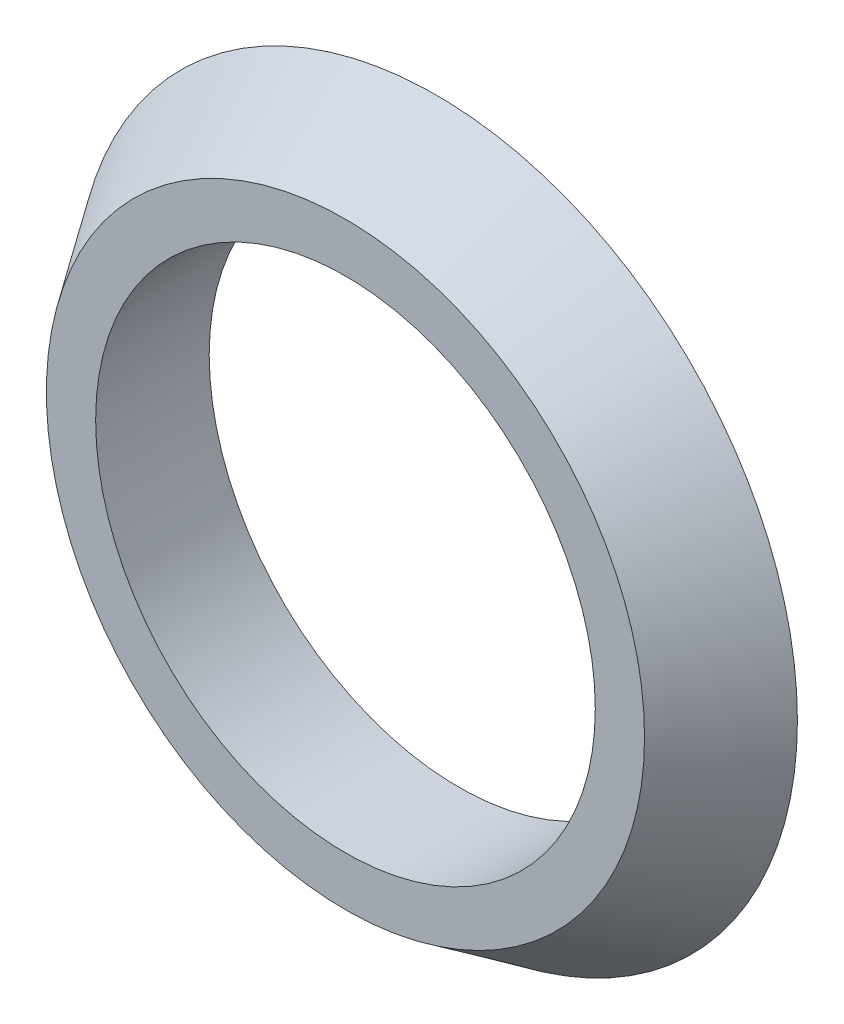
ISO-10303-21;
HEADER;
FILE_DESCRIPTION(('STEP AP214'),'2;1');
FILE_NAME('part.step','',(''),(''),'','','');
FILE_SCHEMA(('AUTOMOTIVE_DESIGN { 1 0 10303 214 1 1 1 1 }'));
ENDSEC;
DATA;
#1=APPLICATION_CONTEXT('core data for automotive mechanical design processes');
#2=APPLICATION_PROTOCOL_DEFINITION('international standard','automotive_design',2000,#1);
#3=PRODUCT_CONTEXT('',#1,'mechanical');
#4=PRODUCT('Part','Part','',(#3));
#5=PRODUCT_RELATED_PRODUCT_CATEGORY('part','',(#4));
#6=PRODUCT_DEFINITION_FORMATION('','',#4);
#7=PRODUCT_DEFINITION_CONTEXT('part definition',#1,'design');
#8=PRODUCT_DEFINITION('design','',#6,#7);
#9=PRODUCT_DEFINITION_SHAPE('','',#8);
#10=(LENGTH_UNIT() NAMED_UNIT(*) SI_UNIT(.MILLI.,.METRE.));
#11=(NAMED_UNIT(*) PLANE_ANGLE_UNIT() SI_UNIT($,.RADIAN.));
#12=(NAMED_UNIT(*) SI_UNIT($,.STERADIAN.) SOLID_ANGLE_UNIT());
#13=UNCERTAINTY_MEASURE_WITH_UNIT(LENGTH_MEASURE(1.E-05),#10,'distance_accuracy_value','');
#14=(GEOMETRIC_REPRESENTATION_CONTEXT(3) GLOBAL_UNCERTAINTY_ASSIGNED_CONTEXT((#13)) GLOBAL_UNIT_ASSIGNED_CONTEXT((#10,
#11,#12)) REPRESENTATION_CONTEXT('',''));
#15=CARTESIAN_POINT('',(0.,0.,0.));
#16=DIRECTION('',(0.,0.,1.));
#17=DIRECTION('',(1.,0.,0.));
#18=AXIS2_PLACEMENT_3D('',#15,#16,#17);
#19=CARTESIAN_POINT('',(0.,0.,2.));
#20=DIRECTION('',(0.,0.,-1.));
#21=DIRECTION('',(1.,0.,0.));
#22=AXIS2_PLACEMENT_3D('',#19,#20,#21);
#23=CYLINDRICAL_SURFACE('',#22,5.5);
#24=CARTESIAN_POINT('',(0.,0.,-0.5));
#25=DIRECTION('',(0.,0.,1.));
#26=DIRECTION('',(-1.,0.,0.));
#27=AXIS2_PLACEMENT_3D('',#24,#25,#26);
#28=CIRCLE('',#27,5.500000003344);
#29=CARTESIAN_POINT('',(-5.500000003344,0.,-0.5));
#30=VERTEX_POINT('',#29);
#31=EDGE_CURVE('E10',#30,#30,#28,.T.);
#32=ORIENTED_EDGE('',*,*,#31,.F.);
#33=EDGE_LOOP('',(#32));
#34=FACE_BOUND('',#33,.T.);
#35=CARTESIAN_POINT('',(0.,0.,2.));
#36=DIRECTION('',(0.,0.,-1.));
#37=DIRECTION('',(1.,0.,0.));
#38=AXIS2_PLACEMENT_3D('',#35,#36,#37);
#39=CIRCLE('',#38,5.499999997123);
#40=CARTESIAN_POINT('',(5.499999997123,0.,2.));
#41=VERTEX_POINT('',#40);
#42=EDGE_CURVE('E19',#41,#41,#39,.T.);
#43=ORIENTED_EDGE('',*,*,#42,.F.);
#44=EDGE_LOOP('',(#43));
#45=FACE_BOUND('',#44,.T.);
#46=ADVANCED_FACE('F15',(#34,#45),#23,.F.);
#47=CARTESIAN_POINT('',(6.072,-6.072,-0.5));
#48=DIRECTION('',(0.,0.,-1.));
#49=DIRECTION('',(0.,-1.,0.));
#50=AXIS2_PLACEMENT_3D('',#47,#48,#49);
#51=PLANE('',#50);
#52=ORIENTED_EDGE('',*,*,#31,.T.);
#53=EDGE_LOOP('',(#52));
#54=FACE_BOUND('',#53,.T.);
#55=CARTESIAN_POINT('',(0.,0.,-0.5));
#56=DIRECTION('',(0.,0.,-1.));
#57=DIRECTION('',(-1.,0.,0.));
#58=AXIS2_PLACEMENT_3D('',#55,#56,#57);
#59=CIRCLE('',#58,5.999999997024);
#60=CARTESIAN_POINT('',(-5.999999997024,0.,-0.5));
#61=VERTEX_POINT('',#60);
#62=EDGE_CURVE('E24',#61,#61,#59,.T.);
#63=ORIENTED_EDGE('',*,*,#62,.T.);
#64=EDGE_LOOP('',(#63));
#65=FACE_BOUND('',#64,.T.);
#66=ADVANCED_FACE('F17',(#54,#65),#51,.T.);
#67=CARTESIAN_POINT('',(0.,0.,-0.5));
#68=DIRECTION('',(0.,0.,1.));
#69=DIRECTION('',(1.,0.,0.));
#70=AXIS2_PLACEMENT_3D('',#67,#68,#69);
#71=CYLINDRICAL_SURFACE('',#70,6.);
#72=CARTESIAN_POINT('',(0.,0.,0.));
#73=DIRECTION('',(0.,0.,-1.));
#74=DIRECTION('',(1.,0.,0.));
#75=AXIS2_PLACEMENT_3D('',#72,#73,#74);
#76=CIRCLE('',#75,6.000000000667);
#77=CARTESIAN_POINT('',(6.000000000667,0.,0.));
#78=VERTEX_POINT('',#77);
#79=EDGE_CURVE('E36',#78,#78,#76,.T.);
#80=ORIENTED_EDGE('',*,*,#79,.T.);
#81=EDGE_LOOP('',(#80));
#82=FACE_BOUND('',#81,.T.);
#83=ORIENTED_EDGE('',*,*,#62,.F.);
#84=EDGE_LOOP('',(#83));
#85=FACE_BOUND('',#84,.T.);
#86=ADVANCED_FACE('F74',(#82,#85),#71,.T.);
#87=CARTESIAN_POINT('',(-6.663613888,-6.663613888,2.));
#88=DIRECTION('',(0.,0.,1.));
#89=DIRECTION('',(1.,0.,0.));
#90=AXIS2_PLACEMENT_3D('',#87,#88,#89);
#91=PLANE('',#90);
#92=ORIENTED_EDGE('',*,*,#42,.T.);
#93=EDGE_LOOP('',(#92));
#94=FACE_BOUND('',#93,.T.);
#95=CARTESIAN_POINT('',(0.,0.,2.));
#96=DIRECTION('',(0.,0.,1.));
#97=DIRECTION('',(1.,0.,0.));
#98=AXIS2_PLACEMENT_3D('',#95,#96,#97);
#99=CIRCLE('',#98,6.584598700291);
#100=CARTESIAN_POINT('',(6.584598700291,0.,2.));
#101=VERTEX_POINT('',#100);
#102=EDGE_CURVE('E38',#101,#101,#99,.T.);
#103=ORIENTED_EDGE('',*,*,#102,.T.);
#104=EDGE_LOOP('',(#103));
#105=FACE_BOUND('',#104,.T.);
#106=ADVANCED_FACE('F65',(#94,#105),#91,.T.);
#107=CARTESIAN_POINT('',(0.,0.,1.));
#108=DIRECTION('',(0.,0.,-1.));
#109=DIRECTION('',(-1.,0.,0.));
#110=AXIS2_PLACEMENT_3D('',#107,#108,#109);
#111=CONICAL_SURFACE('',#110,7.267299352,0.599021063042);
#112=CARTESIAN_POINT('',(0.,0.,0.));
#113=DIRECTION('',(0.,0.,-1.));
#114=DIRECTION('',(1.,0.,0.));
#115=AXIS2_PLACEMENT_3D('',#112,#113,#114);
#116=CIRCLE('',#115,7.949999996057);
#117=CARTESIAN_POINT('',(7.949999996057,0.,0.));
#118=VERTEX_POINT('',#117);
#119=EDGE_CURVE('E49',#118,#118,#116,.T.);
#120=ORIENTED_EDGE('',*,*,#119,.F.);
#121=EDGE_LOOP('',(#120));
#122=FACE_BOUND('',#121,.T.);
#123=ORIENTED_EDGE('',*,*,#102,.F.);
#124=EDGE_LOOP('',(#123));
#125=FACE_BOUND('',#124,.T.);
#126=ADVANCED_FACE('F62',(#122,#125),#111,.T.);
#127=CARTESIAN_POINT('',(-8.0454,-8.0454,0.));
#128=DIRECTION('',(0.,0.,1.));
#129=DIRECTION('',(1.,0.,0.));
#130=AXIS2_PLACEMENT_3D('',#127,#128,#129);
#131=PLANE('',#130);
#132=ORIENTED_EDGE('',*,*,#79,.F.);
#133=EDGE_LOOP('',(#132));
#134=FACE_BOUND('',#133,.T.);
#135=ORIENTED_EDGE('',*,*,#119,.T.);
#136=EDGE_LOOP('',(#135));
#137=FACE_BOUND('',#136,.T.);
#138=ADVANCED_FACE('F60',(#134,#137),#131,.F.);
#139=CLOSED_SHELL('',(#46,#66,#86,#106,#126,#138));
#140=MANIFOLD_SOLID_BREP('B1',#139);
#141=ADVANCED_BREP_SHAPE_REPRESENTATION('',(#18,#140),#14);
#142=SHAPE_DEFINITION_REPRESENTATION(#9,#141);
ENDSEC;
END-ISO-10303-21;
